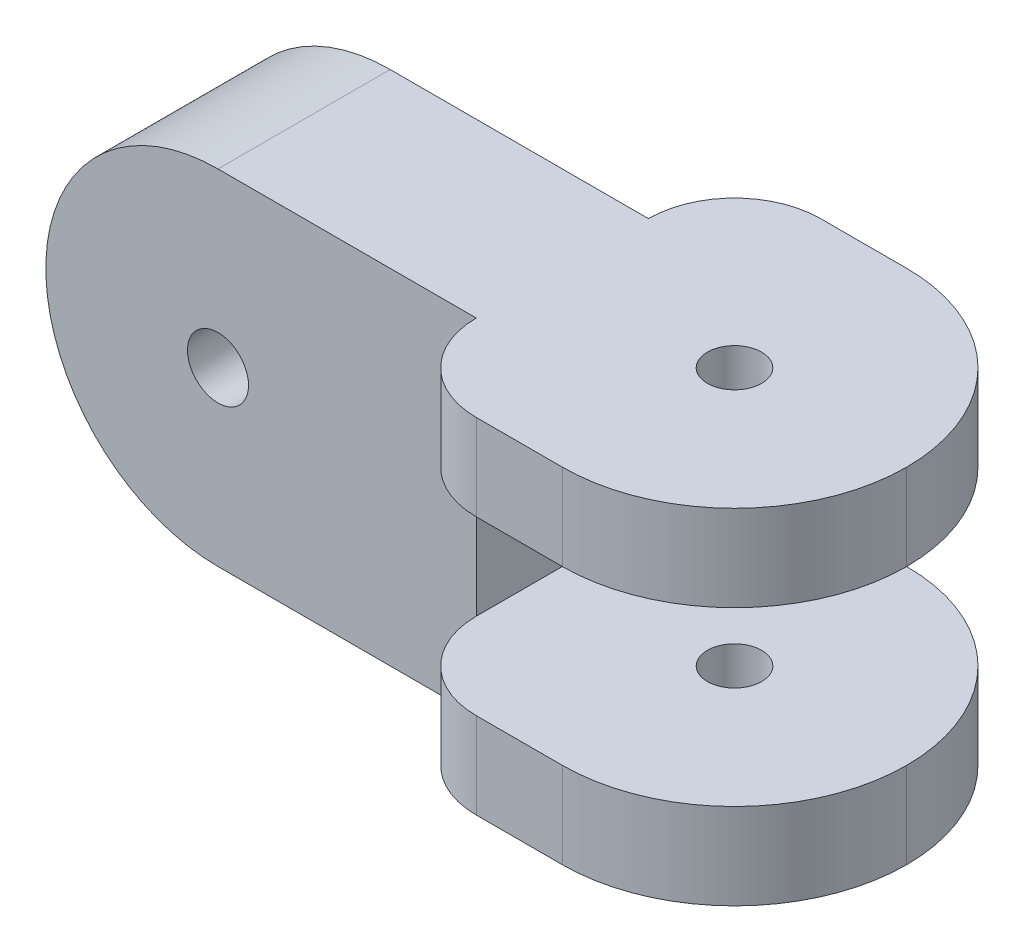
ISO-10303-21;
HEADER;
FILE_DESCRIPTION(('STEP AP214'),'2;1');
FILE_NAME('part.step','',(''),(''),'','','');
FILE_SCHEMA(('AUTOMOTIVE_DESIGN { 1 0 10303 214 1 1 1 1 }'));
ENDSEC;
DATA;
#1=APPLICATION_CONTEXT('core data for automotive mechanical design processes');
#2=APPLICATION_PROTOCOL_DEFINITION('international standard','automotive_design',2000,#1);
#3=PRODUCT_CONTEXT('',#1,'mechanical');
#4=PRODUCT('Part','Part','',(#3));
#5=PRODUCT_RELATED_PRODUCT_CATEGORY('part','',(#4));
#6=PRODUCT_DEFINITION_FORMATION('','',#4);
#7=PRODUCT_DEFINITION_CONTEXT('part definition',#1,'design');
#8=PRODUCT_DEFINITION('design','',#6,#7);
#9=PRODUCT_DEFINITION_SHAPE('','',#8);
#10=(LENGTH_UNIT() NAMED_UNIT(*) SI_UNIT(.MILLI.,.METRE.));
#11=(NAMED_UNIT(*) PLANE_ANGLE_UNIT() SI_UNIT($,.RADIAN.));
#12=(NAMED_UNIT(*) SI_UNIT($,.STERADIAN.) SOLID_ANGLE_UNIT());
#13=UNCERTAINTY_MEASURE_WITH_UNIT(LENGTH_MEASURE(1.E-05),#10,'distance_accuracy_value','');
#14=(GEOMETRIC_REPRESENTATION_CONTEXT(3) GLOBAL_UNCERTAINTY_ASSIGNED_CONTEXT((#13)) GLOBAL_UNIT_ASSIGNED_CONTEXT((#10,
#11,#12)) REPRESENTATION_CONTEXT('',''));
#15=CARTESIAN_POINT('',(0.,0.,0.));
#16=DIRECTION('',(0.,0.,1.));
#17=DIRECTION('',(1.,0.,0.));
#18=AXIS2_PLACEMENT_3D('',#15,#16,#17);
#19=CARTESIAN_POINT('',(44.45,12.7,19.05));
#20=DIRECTION('',(0.,0.,-1.));
#21=DIRECTION('',(-1.,0.,0.));
#22=AXIS2_PLACEMENT_3D('',#19,#20,#21);
#23=PLANE('',#22);
#24=DIRECTION('',(-1.,0.,0.));
#25=VECTOR('',#24,1.);
#26=CARTESIAN_POINT('',(44.45,-12.7,19.05));
#27=LINE('',#26,#25);
#28=CARTESIAN_POINT('',(31.75,-12.7,19.05));
#29=VERTEX_POINT('',#28);
#30=CARTESIAN_POINT('',(25.4,-12.7,19.05));
#31=VERTEX_POINT('',#30);
#32=EDGE_CURVE('E205',#29,#31,#27,.T.);
#33=ORIENTED_EDGE('',*,*,#32,.F.);
#34=DIRECTION('',(0.,-1.,0.));
#35=VECTOR('',#34,1.);
#36=CARTESIAN_POINT('',(31.75,-6.34999999999999,19.05));
#37=LINE('',#36,#35);
#38=CARTESIAN_POINT('',(31.75,-6.34999999999999,19.05));
#39=VERTEX_POINT('',#38);
#40=EDGE_CURVE('E256',#29,#39,#37,.F.);
#41=ORIENTED_EDGE('',*,*,#40,.T.);
#42=DIRECTION('',(1.,0.,0.));
#43=VECTOR('',#42,1.);
#44=CARTESIAN_POINT('',(44.45,-6.34999999999999,19.05));
#45=LINE('',#44,#43);
#46=CARTESIAN_POINT('',(25.4,-6.34999999999999,19.05));
#47=VERTEX_POINT('',#46);
#48=EDGE_CURVE('E282',#47,#39,#45,.T.);
#49=ORIENTED_EDGE('',*,*,#48,.F.);
#50=DIRECTION('',(0.,-1.,0.));
#51=VECTOR('',#50,1.);
#52=CARTESIAN_POINT('',(25.4,12.7,19.05));
#53=LINE('',#52,#51);
#54=EDGE_CURVE('E224',#47,#31,#53,.T.);
#55=ORIENTED_EDGE('',*,*,#54,.T.);
#56=EDGE_LOOP('',(#33,#41,#49,#55));
#57=FACE_BOUND('',#56,.T.);
#58=ADVANCED_FACE('F36',(#57),#23,.F.);
#59=CARTESIAN_POINT('',(44.45,12.7,-6.35));
#60=DIRECTION('',(0.,0.,-1.));
#61=DIRECTION('',(0.,1.,0.));
#62=AXIS2_PLACEMENT_3D('',#59,#60,#61);
#63=PLANE('',#62);
#64=DIRECTION('',(1.,0.,0.));
#65=VECTOR('',#64,1.);
#66=CARTESIAN_POINT('',(44.45,-6.34999999999999,-6.35));
#67=LINE('',#66,#65);
#68=CARTESIAN_POINT('',(25.4,-6.34999999999999,-6.35));
#69=VERTEX_POINT('',#68);
#70=CARTESIAN_POINT('',(31.75,-6.34999999999999,-6.35));
#71=VERTEX_POINT('',#70);
#72=EDGE_CURVE('E174',#69,#71,#67,.T.);
#73=ORIENTED_EDGE('',*,*,#72,.T.);
#74=DIRECTION('',(0.,-1.,0.));
#75=VECTOR('',#74,1.);
#76=CARTESIAN_POINT('',(31.75,12.7,-6.35));
#77=LINE('',#76,#75);
#78=CARTESIAN_POINT('',(31.75,-12.7,-6.35));
#79=VERTEX_POINT('',#78);
#80=EDGE_CURVE('E11',#71,#79,#77,.T.);
#81=ORIENTED_EDGE('',*,*,#80,.T.);
#82=DIRECTION('',(-1.,0.,0.));
#83=VECTOR('',#82,1.);
#84=CARTESIAN_POINT('',(44.45,-12.7,-6.35));
#85=LINE('',#84,#83);
#86=CARTESIAN_POINT('',(25.4,-12.7,-6.35));
#87=VERTEX_POINT('',#86);
#88=EDGE_CURVE('E290',#79,#87,#85,.T.);
#89=ORIENTED_EDGE('',*,*,#88,.T.);
#90=DIRECTION('',(0.,-1.,0.));
#91=VECTOR('',#90,1.);
#92=CARTESIAN_POINT('',(25.4,-6.34999999999999,-6.35));
#93=LINE('',#92,#91);
#94=EDGE_CURVE('E236',#87,#69,#93,.F.);
#95=ORIENTED_EDGE('',*,*,#94,.T.);
#96=EDGE_LOOP('',(#73,#81,#89,#95));
#97=FACE_BOUND('',#96,.T.);
#98=ADVANCED_FACE('F317',(#97),#63,.T.);
#99=CARTESIAN_POINT('',(0.,12.7,12.7));
#100=DIRECTION('',(0.,1.,0.));
#101=DIRECTION('',(0.,0.,1.));
#102=AXIS2_PLACEMENT_3D('',#99,#100,#101);
#103=PLANE('',#102);
#104=CARTESIAN_POINT('',(31.75,12.7,6.35));
#105=DIRECTION('',(0.,1.,0.));
#106=DIRECTION('',(0.,0.,1.));
#107=AXIS2_PLACEMENT_3D('',#104,#105,#106);
#108=CIRCLE('',#107,2.);
#109=CARTESIAN_POINT('',(31.75,12.7,8.35));
#110=VERTEX_POINT('',#109);
#111=EDGE_CURVE('E278',#110,#110,#108,.T.);
#112=ORIENTED_EDGE('',*,*,#111,.F.);
#113=EDGE_LOOP('',(#112));
#114=FACE_BOUND('',#113,.T.);
#115=DIRECTION('',(-1.,0.,0.));
#116=VECTOR('',#115,1.);
#117=CARTESIAN_POINT('',(44.45,12.7,19.05));
#118=LINE('',#117,#116);
#119=CARTESIAN_POINT('',(31.75,12.7,19.05));
#120=VERTEX_POINT('',#119);
#121=CARTESIAN_POINT('',(25.4,12.7,19.05));
#122=VERTEX_POINT('',#121);
#123=EDGE_CURVE('E187',#120,#122,#118,.T.);
#124=ORIENTED_EDGE('',*,*,#123,.F.);
#125=CARTESIAN_POINT('',(31.75,12.7,6.35));
#126=DIRECTION('',(0.,1.,0.));
#127=DIRECTION('',(0.,0.,1.));
#128=AXIS2_PLACEMENT_3D('',#125,#126,#127);
#129=CIRCLE('',#128,12.7);
#130=CARTESIAN_POINT('',(44.45,12.7,6.35));
#131=VERTEX_POINT('',#130);
#132=EDGE_CURVE('E250',#120,#131,#129,.T.);
#133=ORIENTED_EDGE('',*,*,#132,.T.);
#134=CARTESIAN_POINT('',(31.75,12.7,6.35));
#135=DIRECTION('',(0.,1.,0.));
#136=DIRECTION('',(0.,0.,1.));
#137=AXIS2_PLACEMENT_3D('',#134,#135,#136);
#138=CIRCLE('',#137,12.7);
#139=CARTESIAN_POINT('',(31.75,12.7,-6.35));
#140=VERTEX_POINT('',#139);
#141=EDGE_CURVE('E248',#131,#140,#138,.T.);
#142=ORIENTED_EDGE('',*,*,#141,.T.);
#143=DIRECTION('',(-1.,0.,0.));
#144=VECTOR('',#143,1.);
#145=CARTESIAN_POINT('',(44.45,12.7,-6.35));
#146=LINE('',#145,#144);
#147=CARTESIAN_POINT('',(25.4,12.7,-6.35));
#148=VERTEX_POINT('',#147);
#149=EDGE_CURVE('E288',#140,#148,#146,.T.);
#150=ORIENTED_EDGE('',*,*,#149,.T.);
#151=CARTESIAN_POINT('',(25.4,12.7,0.));
#152=DIRECTION('',(0.,1.,0.));
#153=DIRECTION('',(0.,0.,1.));
#154=AXIS2_PLACEMENT_3D('',#151,#152,#153);
#155=CIRCLE('',#154,6.35);
#156=CARTESIAN_POINT('',(19.05,12.7,0.));
#157=VERTEX_POINT('',#156);
#158=EDGE_CURVE('E161',#148,#157,#155,.T.);
#159=ORIENTED_EDGE('',*,*,#158,.T.);
#160=DIRECTION('',(1.,0.,0.));
#161=VECTOR('',#160,1.);
#162=CARTESIAN_POINT('',(0.,12.7,0.));
#163=LINE('',#162,#161);
#164=CARTESIAN_POINT('',(0.,12.7,0.));
#165=VERTEX_POINT('',#164);
#166=EDGE_CURVE('E204',#165,#157,#163,.T.);
#167=ORIENTED_EDGE('',*,*,#166,.F.);
#168=DIRECTION('',(0.,0.,-1.));
#169=VECTOR('',#168,1.);
#170=CARTESIAN_POINT('',(0.,12.7,12.7));
#171=LINE('',#170,#169);
#172=CARTESIAN_POINT('',(0.,12.7,12.7));
#173=VERTEX_POINT('',#172);
#174=EDGE_CURVE('E195',#173,#165,#171,.T.);
#175=ORIENTED_EDGE('',*,*,#174,.F.);
#176=DIRECTION('',(1.,0.,0.));
#177=VECTOR('',#176,1.);
#178=CARTESIAN_POINT('',(0.,12.7,12.7));
#179=LINE('',#178,#177);
#180=CARTESIAN_POINT('',(19.05,12.7,12.7));
#181=VERTEX_POINT('',#180);
#182=EDGE_CURVE('E295',#173,#181,#179,.T.);
#183=ORIENTED_EDGE('',*,*,#182,.T.);
#184=CARTESIAN_POINT('',(25.4,12.7,12.7));
#185=DIRECTION('',(0.,1.,0.));
#186=DIRECTION('',(0.,0.,1.));
#187=AXIS2_PLACEMENT_3D('',#184,#185,#186);
#188=CIRCLE('',#187,6.35);
#189=EDGE_CURVE('E191',#181,#122,#188,.T.);
#190=ORIENTED_EDGE('',*,*,#189,.T.);
#191=EDGE_LOOP('',(#124,#133,#142,#150,#159,#167,#175,#183,#190));
#192=FACE_BOUND('',#191,.T.);
#193=ADVANCED_FACE('F349',(#114,#192),#103,.T.);
#194=CARTESIAN_POINT('',(0.,0.,12.7));
#195=DIRECTION('',(0.,0.,-1.));
#196=DIRECTION('',(-1.,0.,0.));
#197=AXIS2_PLACEMENT_3D('',#194,#195,#196);
#198=CYLINDRICAL_SURFACE('',#197,12.7);
#199=CARTESIAN_POINT('',(0.,0.,0.));
#200=DIRECTION('',(0.,0.,1.));
#201=DIRECTION('',(1.,0.,0.));
#202=AXIS2_PLACEMENT_3D('',#199,#200,#201);
#203=CIRCLE('',#202,12.7);
#204=CARTESIAN_POINT('',(0.,-12.7,0.));
#205=VERTEX_POINT('',#204);
#206=EDGE_CURVE('E208',#165,#205,#203,.T.);
#207=ORIENTED_EDGE('',*,*,#206,.T.);
#208=DIRECTION('',(0.,0.,-1.));
#209=VECTOR('',#208,1.);
#210=CARTESIAN_POINT('',(0.,-12.7,12.7));
#211=LINE('',#210,#209);
#212=CARTESIAN_POINT('',(0.,-12.7,12.7));
#213=VERTEX_POINT('',#212);
#214=EDGE_CURVE('E192',#213,#205,#211,.T.);
#215=ORIENTED_EDGE('',*,*,#214,.F.);
#216=CARTESIAN_POINT('',(0.,0.,12.7));
#217=DIRECTION('',(0.,0.,1.));
#218=DIRECTION('',(1.,0.,0.));
#219=AXIS2_PLACEMENT_3D('',#216,#217,#218);
#220=CIRCLE('',#219,12.7);
#221=EDGE_CURVE('E296',#173,#213,#220,.T.);
#222=ORIENTED_EDGE('',*,*,#221,.F.);
#223=ORIENTED_EDGE('',*,*,#174,.T.);
#224=EDGE_LOOP('',(#207,#215,#222,#223));
#225=FACE_BOUND('',#224,.T.);
#226=ADVANCED_FACE('F351',(#225),#198,.T.);
#227=CARTESIAN_POINT('',(0.,-12.7,12.7));
#228=DIRECTION('',(0.,1.,0.));
#229=DIRECTION('',(0.,0.,1.));
#230=AXIS2_PLACEMENT_3D('',#227,#228,#229);
#231=PLANE('',#230);
#232=CARTESIAN_POINT('',(31.75,-12.7,6.35));
#233=DIRECTION('',(0.,1.,0.));
#234=DIRECTION('',(0.,0.,1.));
#235=AXIS2_PLACEMENT_3D('',#232,#233,#234);
#236=CIRCLE('',#235,2.);
#237=CARTESIAN_POINT('',(31.75,-12.7,8.35));
#238=VERTEX_POINT('',#237);
#239=EDGE_CURVE('E275',#238,#238,#236,.T.);
#240=ORIENTED_EDGE('',*,*,#239,.T.);
#241=EDGE_LOOP('',(#240));
#242=FACE_BOUND('',#241,.T.);
#243=CARTESIAN_POINT('',(31.75,-12.7,6.34999999999999));
#244=DIRECTION('',(0.,1.,0.));
#245=DIRECTION('',(0.,0.,1.));
#246=AXIS2_PLACEMENT_3D('',#243,#244,#245);
#247=CIRCLE('',#246,12.7);
#248=CARTESIAN_POINT('',(44.45,-12.7,6.35));
#249=VERTEX_POINT('',#248);
#250=EDGE_CURVE('E252',#79,#249,#247,.F.);
#251=ORIENTED_EDGE('',*,*,#250,.T.);
#252=CARTESIAN_POINT('',(31.75,-12.7,6.35));
#253=DIRECTION('',(0.,1.,0.));
#254=DIRECTION('',(0.,0.,1.));
#255=AXIS2_PLACEMENT_3D('',#252,#253,#254);
#256=CIRCLE('',#255,12.7);
#257=EDGE_CURVE('E254',#249,#29,#256,.F.);
#258=ORIENTED_EDGE('',*,*,#257,.T.);
#259=ORIENTED_EDGE('',*,*,#32,.T.);
#260=CARTESIAN_POINT('',(25.4,-12.7,12.7));
#261=DIRECTION('',(0.,1.,0.));
#262=DIRECTION('',(0.,0.,1.));
#263=AXIS2_PLACEMENT_3D('',#260,#261,#262);
#264=CIRCLE('',#263,6.35);
#265=CARTESIAN_POINT('',(19.05,-12.7,12.7));
#266=VERTEX_POINT('',#265);
#267=EDGE_CURVE('E230',#31,#266,#264,.F.);
#268=ORIENTED_EDGE('',*,*,#267,.T.);
#269=DIRECTION('',(1.,0.,0.));
#270=VECTOR('',#269,1.);
#271=CARTESIAN_POINT('',(0.,-12.7,12.7));
#272=LINE('',#271,#270);
#273=EDGE_CURVE('E197',#213,#266,#272,.T.);
#274=ORIENTED_EDGE('',*,*,#273,.F.);
#275=ORIENTED_EDGE('',*,*,#214,.T.);
#276=DIRECTION('',(1.,0.,0.));
#277=VECTOR('',#276,1.);
#278=CARTESIAN_POINT('',(0.,-12.7,0.));
#279=LINE('',#278,#277);
#280=CARTESIAN_POINT('',(19.05,-12.7,0.));
#281=VERTEX_POINT('',#280);
#282=EDGE_CURVE('E211',#205,#281,#279,.T.);
#283=ORIENTED_EDGE('',*,*,#282,.T.);
#284=CARTESIAN_POINT('',(25.4,-12.7,0.));
#285=DIRECTION('',(0.,1.,0.));
#286=DIRECTION('',(0.,0.,1.));
#287=AXIS2_PLACEMENT_3D('',#284,#285,#286);
#288=CIRCLE('',#287,6.35);
#289=EDGE_CURVE('E227',#281,#87,#288,.F.);
#290=ORIENTED_EDGE('',*,*,#289,.T.);
#291=ORIENTED_EDGE('',*,*,#88,.F.);
#292=EDGE_LOOP('',(#251,#258,#259,#268,#274,#275,#283,#290,#291));
#293=FACE_BOUND('',#292,.T.);
#294=ADVANCED_FACE('F311',(#242,#293),#231,.F.);
#295=CARTESIAN_POINT('',(0.,0.,12.7));
#296=DIRECTION('',(0.,0.,-1.));
#297=DIRECTION('',(-1.,0.,0.));
#298=AXIS2_PLACEMENT_3D('',#295,#296,#297);
#299=CYLINDRICAL_SURFACE('',#298,2.25);
#300=CARTESIAN_POINT('',(0.,0.,12.7));
#301=DIRECTION('',(0.,0.,1.));
#302=DIRECTION('',(1.,0.,0.));
#303=AXIS2_PLACEMENT_3D('',#300,#301,#302);
#304=CIRCLE('',#303,2.25);
#305=CARTESIAN_POINT('',(2.25,0.,12.7));
#306=VERTEX_POINT('',#305);
#307=EDGE_CURVE('E216',#306,#306,#304,.T.);
#308=ORIENTED_EDGE('',*,*,#307,.T.);
#309=EDGE_LOOP('',(#308));
#310=FACE_BOUND('',#309,.T.);
#311=CARTESIAN_POINT('',(0.,0.,0.));
#312=DIRECTION('',(0.,0.,1.));
#313=DIRECTION('',(1.,0.,0.));
#314=AXIS2_PLACEMENT_3D('',#311,#312,#313);
#315=CIRCLE('',#314,2.25);
#316=CARTESIAN_POINT('',(2.25,0.,0.));
#317=VERTEX_POINT('',#316);
#318=EDGE_CURVE('E201',#317,#317,#315,.T.);
#319=ORIENTED_EDGE('',*,*,#318,.F.);
#320=EDGE_LOOP('',(#319));
#321=FACE_BOUND('',#320,.T.);
#322=ADVANCED_FACE('F358',(#310,#321),#299,.F.);
#323=CARTESIAN_POINT('',(0.,0.,12.7));
#324=DIRECTION('',(0.,0.,1.));
#325=DIRECTION('',(1.,0.,0.));
#326=AXIS2_PLACEMENT_3D('',#323,#324,#325);
#327=PLANE('',#326);
#328=ORIENTED_EDGE('',*,*,#307,.F.);
#329=EDGE_LOOP('',(#328));
#330=FACE_BOUND('',#329,.T.);
#331=ORIENTED_EDGE('',*,*,#182,.F.);
#332=ORIENTED_EDGE('',*,*,#221,.T.);
#333=ORIENTED_EDGE('',*,*,#273,.T.);
#334=DIRECTION('',(0.,-1.,0.));
#335=VECTOR('',#334,1.);
#336=CARTESIAN_POINT('',(19.05,0.,12.7));
#337=LINE('',#336,#335);
#338=CARTESIAN_POINT('',(19.05,-6.34999999999999,12.7));
#339=VERTEX_POINT('',#338);
#340=EDGE_CURVE('E185',#339,#266,#337,.T.);
#341=ORIENTED_EDGE('',*,*,#340,.F.);
#342=DIRECTION('',(0.,-1.,0.));
#343=VECTOR('',#342,1.);
#344=CARTESIAN_POINT('',(19.05,0.,12.7));
#345=LINE('',#344,#343);
#346=CARTESIAN_POINT('',(19.05,6.35000000000001,12.7));
#347=VERTEX_POINT('',#346);
#348=EDGE_CURVE('E168',#347,#339,#345,.T.);
#349=ORIENTED_EDGE('',*,*,#348,.F.);
#350=EDGE_CURVE('E181',#181,#347,#337,.T.);
#351=ORIENTED_EDGE('',*,*,#350,.F.);
#352=EDGE_LOOP('',(#331,#332,#333,#341,#349,#351));
#353=FACE_BOUND('',#352,.T.);
#354=ADVANCED_FACE('F180',(#330,#353),#327,.T.);
#355=CARTESIAN_POINT('',(0.,0.,0.));
#356=DIRECTION('',(0.,0.,1.));
#357=DIRECTION('',(1.,0.,0.));
#358=AXIS2_PLACEMENT_3D('',#355,#356,#357);
#359=PLANE('',#358);
#360=ORIENTED_EDGE('',*,*,#318,.T.);
#361=EDGE_LOOP('',(#360));
#362=FACE_BOUND('',#361,.T.);
#363=ORIENTED_EDGE('',*,*,#166,.T.);
#364=DIRECTION('',(0.,-1.,0.));
#365=VECTOR('',#364,1.);
#366=CARTESIAN_POINT('',(19.05,0.,0.));
#367=LINE('',#366,#365);
#368=CARTESIAN_POINT('',(19.05,6.35000000000001,0.));
#369=VERTEX_POINT('',#368);
#370=EDGE_CURVE('E215',#157,#369,#367,.T.);
#371=ORIENTED_EDGE('',*,*,#370,.T.);
#372=CARTESIAN_POINT('',(19.05,-6.34999999999999,0.));
#373=VERTEX_POINT('',#372);
#374=EDGE_CURVE('E171',#369,#373,#367,.T.);
#375=ORIENTED_EDGE('',*,*,#374,.T.);
#376=EDGE_CURVE('E214',#373,#281,#367,.T.);
#377=ORIENTED_EDGE('',*,*,#376,.T.);
#378=ORIENTED_EDGE('',*,*,#282,.F.);
#379=ORIENTED_EDGE('',*,*,#206,.F.);
#380=EDGE_LOOP('',(#363,#371,#375,#377,#378,#379));
#381=FACE_BOUND('',#380,.T.);
#382=ADVANCED_FACE('F325',(#362,#381),#359,.F.);
#383=DIRECTION('',(-1.,0.,0.));
#384=VECTOR('',#383,1.);
#385=CARTESIAN_POINT('',(44.45,6.35000000000001,19.05));
#386=LINE('',#385,#384);
#387=CARTESIAN_POINT('',(31.75,6.35000000000001,19.05));
#388=VERTEX_POINT('',#387);
#389=CARTESIAN_POINT('',(25.4,6.35000000000001,19.05));
#390=VERTEX_POINT('',#389);
#391=EDGE_CURVE('E156',#388,#390,#386,.T.);
#392=ORIENTED_EDGE('',*,*,#391,.F.);
#393=DIRECTION('',(0.,-1.,0.));
#394=VECTOR('',#393,1.);
#395=CARTESIAN_POINT('',(31.75,12.7,19.05));
#396=LINE('',#395,#394);
#397=EDGE_CURVE('E245',#388,#120,#396,.F.);
#398=ORIENTED_EDGE('',*,*,#397,.T.);
#399=ORIENTED_EDGE('',*,*,#123,.T.);
#400=DIRECTION('',(0.,-1.,0.));
#401=VECTOR('',#400,1.);
#402=CARTESIAN_POINT('',(25.4,12.7,19.05));
#403=LINE('',#402,#401);
#404=EDGE_CURVE('E219',#122,#390,#403,.T.);
#405=ORIENTED_EDGE('',*,*,#404,.T.);
#406=EDGE_LOOP('',(#392,#398,#399,#405));
#407=FACE_BOUND('',#406,.T.);
#408=ADVANCED_FACE('F346',(#407),#23,.F.);
#409=ORIENTED_EDGE('',*,*,#149,.F.);
#410=DIRECTION('',(0.,-1.,0.));
#411=VECTOR('',#410,1.);
#412=CARTESIAN_POINT('',(31.75,12.7,-6.35));
#413=LINE('',#412,#411);
#414=CARTESIAN_POINT('',(31.75,6.35000000000001,-6.35));
#415=VERTEX_POINT('',#414);
#416=EDGE_CURVE('E45',#140,#415,#413,.T.);
#417=ORIENTED_EDGE('',*,*,#416,.T.);
#418=DIRECTION('',(-1.,0.,0.));
#419=VECTOR('',#418,1.);
#420=CARTESIAN_POINT('',(44.45,6.35000000000001,-6.35));
#421=LINE('',#420,#419);
#422=CARTESIAN_POINT('',(25.4,6.35000000000001,-6.35));
#423=VERTEX_POINT('',#422);
#424=EDGE_CURVE('E280',#415,#423,#421,.T.);
#425=ORIENTED_EDGE('',*,*,#424,.T.);
#426=DIRECTION('',(0.,-1.,0.));
#427=VECTOR('',#426,1.);
#428=CARTESIAN_POINT('',(25.4,12.7,-6.35));
#429=LINE('',#428,#427);
#430=EDGE_CURVE('E238',#423,#148,#429,.F.);
#431=ORIENTED_EDGE('',*,*,#430,.T.);
#432=EDGE_LOOP('',(#409,#417,#425,#431));
#433=FACE_BOUND('',#432,.T.);
#434=ADVANCED_FACE('F369',(#433),#63,.T.);
#435=CARTESIAN_POINT('',(19.05,6.35000000000001,-6.35));
#436=DIRECTION('',(-1.,0.,0.));
#437=DIRECTION('',(0.,0.,1.));
#438=AXIS2_PLACEMENT_3D('',#435,#436,#437);
#439=PLANE('',#438);
#440=ORIENTED_EDGE('',*,*,#348,.T.);
#441=DIRECTION('',(0.,0.,1.));
#442=VECTOR('',#441,1.);
#443=CARTESIAN_POINT('',(19.05,-6.34999999999999,-6.35));
#444=LINE('',#443,#442);
#445=EDGE_CURVE('E173',#373,#339,#444,.T.);
#446=ORIENTED_EDGE('',*,*,#445,.F.);
#447=ORIENTED_EDGE('',*,*,#374,.F.);
#448=DIRECTION('',(0.,0.,1.));
#449=VECTOR('',#448,1.);
#450=CARTESIAN_POINT('',(19.05,6.35000000000001,-6.35));
#451=LINE('',#450,#449);
#452=EDGE_CURVE('E153',#369,#347,#451,.T.);
#453=ORIENTED_EDGE('',*,*,#452,.T.);
#454=EDGE_LOOP('',(#440,#446,#447,#453));
#455=FACE_BOUND('',#454,.T.);
#456=ADVANCED_FACE('F166',(#455),#439,.F.);
#457=CARTESIAN_POINT('',(44.45,-6.34999999999999,-6.35));
#458=DIRECTION('',(0.,-1.,0.));
#459=DIRECTION('',(1.,0.,0.));
#460=AXIS2_PLACEMENT_3D('',#457,#458,#459);
#461=PLANE('',#460);
#462=CARTESIAN_POINT('',(31.75,-6.34999999999999,6.35));
#463=DIRECTION('',(0.,-1.,0.));
#464=DIRECTION('',(1.,0.,0.));
#465=AXIS2_PLACEMENT_3D('',#462,#463,#464);
#466=CIRCLE('',#465,2.);
#467=CARTESIAN_POINT('',(33.75,-6.34999999999999,6.35));
#468=VERTEX_POINT('',#467);
#469=EDGE_CURVE('E266',#468,#468,#466,.T.);
#470=ORIENTED_EDGE('',*,*,#469,.T.);
#471=EDGE_LOOP('',(#470));
#472=FACE_BOUND('',#471,.T.);
#473=ORIENTED_EDGE('',*,*,#48,.T.);
#474=CARTESIAN_POINT('',(31.75,-6.34999999999999,6.35));
#475=DIRECTION('',(0.,-1.,0.));
#476=DIRECTION('',(1.,0.,0.));
#477=AXIS2_PLACEMENT_3D('',#474,#475,#476);
#478=CIRCLE('',#477,12.7);
#479=CARTESIAN_POINT('',(44.45,-6.34999999999999,6.34999999999999));
#480=VERTEX_POINT('',#479);
#481=EDGE_CURVE('E58',#39,#480,#478,.F.);
#482=ORIENTED_EDGE('',*,*,#481,.T.);
#483=CARTESIAN_POINT('',(31.75,-6.34999999999999,6.35));
#484=DIRECTION('',(0.,-1.,0.));
#485=DIRECTION('',(1.,0.,0.));
#486=AXIS2_PLACEMENT_3D('',#483,#484,#485);
#487=CIRCLE('',#486,12.7);
#488=EDGE_CURVE('E53',#480,#71,#487,.F.);
#489=ORIENTED_EDGE('',*,*,#488,.T.);
#490=ORIENTED_EDGE('',*,*,#72,.F.);
#491=CARTESIAN_POINT('',(25.4,-6.34999999999999,0.));
#492=DIRECTION('',(0.,-1.,0.));
#493=DIRECTION('',(1.,0.,0.));
#494=AXIS2_PLACEMENT_3D('',#491,#492,#493);
#495=CIRCLE('',#494,6.35);
#496=EDGE_CURVE('E232',#69,#373,#495,.F.);
#497=ORIENTED_EDGE('',*,*,#496,.T.);
#498=ORIENTED_EDGE('',*,*,#445,.T.);
#499=CARTESIAN_POINT('',(25.4,-6.34999999999999,12.7));
#500=DIRECTION('',(0.,-1.,0.));
#501=DIRECTION('',(1.,0.,0.));
#502=AXIS2_PLACEMENT_3D('',#499,#500,#501);
#503=CIRCLE('',#502,6.35);
#504=EDGE_CURVE('E234',#339,#47,#503,.F.);
#505=ORIENTED_EDGE('',*,*,#504,.T.);
#506=EDGE_LOOP('',(#473,#482,#489,#490,#497,#498,#505));
#507=FACE_BOUND('',#506,.T.);
#508=ADVANCED_FACE('F306',(#472,#507),#461,.F.);
#509=CARTESIAN_POINT('',(44.45,6.35000000000001,-6.35));
#510=DIRECTION('',(0.,1.,0.));
#511=DIRECTION('',(-1.,0.,0.));
#512=AXIS2_PLACEMENT_3D('',#509,#510,#511);
#513=PLANE('',#512);
#514=CARTESIAN_POINT('',(31.75,6.35000000000001,6.35));
#515=DIRECTION('',(0.,1.,0.));
#516=DIRECTION('',(-1.,0.,0.));
#517=AXIS2_PLACEMENT_3D('',#514,#515,#516);
#518=CIRCLE('',#517,2.);
#519=CARTESIAN_POINT('',(29.75,6.35000000000001,6.35));
#520=VERTEX_POINT('',#519);
#521=EDGE_CURVE('E40',#520,#520,#518,.T.);
#522=ORIENTED_EDGE('',*,*,#521,.T.);
#523=EDGE_LOOP('',(#522));
#524=FACE_BOUND('',#523,.T.);
#525=CARTESIAN_POINT('',(31.75,6.35000000000001,6.35));
#526=DIRECTION('',(0.,1.,0.));
#527=DIRECTION('',(-1.,0.,0.));
#528=AXIS2_PLACEMENT_3D('',#525,#526,#527);
#529=CIRCLE('',#528,12.7);
#530=CARTESIAN_POINT('',(44.45,6.35000000000001,6.35));
#531=VERTEX_POINT('',#530);
#532=EDGE_CURVE('E241',#415,#531,#529,.F.);
#533=ORIENTED_EDGE('',*,*,#532,.T.);
#534=CARTESIAN_POINT('',(31.75,6.35000000000001,6.35));
#535=DIRECTION('',(0.,1.,0.));
#536=DIRECTION('',(-1.,0.,0.));
#537=AXIS2_PLACEMENT_3D('',#534,#535,#536);
#538=CIRCLE('',#537,12.7);
#539=EDGE_CURVE('E243',#531,#388,#538,.F.);
#540=ORIENTED_EDGE('',*,*,#539,.T.);
#541=ORIENTED_EDGE('',*,*,#391,.T.);
#542=CARTESIAN_POINT('',(25.4,6.35000000000001,12.7));
#543=DIRECTION('',(0.,1.,0.));
#544=DIRECTION('',(-1.,0.,0.));
#545=AXIS2_PLACEMENT_3D('',#542,#543,#544);
#546=CIRCLE('',#545,6.35);
#547=EDGE_CURVE('E149',#390,#347,#546,.F.);
#548=ORIENTED_EDGE('',*,*,#547,.T.);
#549=ORIENTED_EDGE('',*,*,#452,.F.);
#550=CARTESIAN_POINT('',(25.4,6.35000000000001,0.));
#551=DIRECTION('',(0.,1.,0.));
#552=DIRECTION('',(-1.,0.,0.));
#553=AXIS2_PLACEMENT_3D('',#550,#551,#552);
#554=CIRCLE('',#553,6.35);
#555=EDGE_CURVE('E162',#369,#423,#554,.F.);
#556=ORIENTED_EDGE('',*,*,#555,.T.);
#557=ORIENTED_EDGE('',*,*,#424,.F.);
#558=EDGE_LOOP('',(#533,#540,#541,#548,#549,#556,#557));
#559=FACE_BOUND('',#558,.T.);
#560=ADVANCED_FACE('F151',(#524,#559),#513,.F.);
#561=CARTESIAN_POINT('',(25.4,12.7,12.7));
#562=DIRECTION('',(0.,-1.,0.));
#563=DIRECTION('',(1.,0.,0.));
#564=AXIS2_PLACEMENT_3D('',#561,#562,#563);
#565=CYLINDRICAL_SURFACE('',#564,6.35);
#566=ORIENTED_EDGE('',*,*,#189,.F.);
#567=ORIENTED_EDGE('',*,*,#350,.T.);
#568=ORIENTED_EDGE('',*,*,#547,.F.);
#569=ORIENTED_EDGE('',*,*,#404,.F.);
#570=EDGE_LOOP('',(#566,#567,#568,#569));
#571=FACE_BOUND('',#570,.T.);
#572=ADVANCED_FACE('F189',(#571),#565,.T.);
#573=CARTESIAN_POINT('',(25.4,12.7,12.7));
#574=DIRECTION('',(0.,-1.,0.));
#575=DIRECTION('',(1.,0.,0.));
#576=AXIS2_PLACEMENT_3D('',#573,#574,#575);
#577=CYLINDRICAL_SURFACE('',#576,6.35);
#578=ORIENTED_EDGE('',*,*,#504,.F.);
#579=ORIENTED_EDGE('',*,*,#340,.T.);
#580=ORIENTED_EDGE('',*,*,#267,.F.);
#581=ORIENTED_EDGE('',*,*,#54,.F.);
#582=EDGE_LOOP('',(#578,#579,#580,#581));
#583=FACE_BOUND('',#582,.T.);
#584=ADVANCED_FACE('F303',(#583),#577,.T.);
#585=CARTESIAN_POINT('',(25.4,0.,0.));
#586=DIRECTION('',(0.,1.,0.));
#587=DIRECTION('',(-1.,0.,0.));
#588=AXIS2_PLACEMENT_3D('',#585,#586,#587);
#589=CYLINDRICAL_SURFACE('',#588,6.35);
#590=ORIENTED_EDGE('',*,*,#496,.F.);
#591=ORIENTED_EDGE('',*,*,#94,.F.);
#592=ORIENTED_EDGE('',*,*,#289,.F.);
#593=ORIENTED_EDGE('',*,*,#376,.F.);
#594=EDGE_LOOP('',(#590,#591,#592,#593));
#595=FACE_BOUND('',#594,.T.);
#596=ADVANCED_FACE('F322',(#595),#589,.T.);
#597=CARTESIAN_POINT('',(25.4,0.,0.));
#598=DIRECTION('',(0.,1.,0.));
#599=DIRECTION('',(-1.,0.,0.));
#600=AXIS2_PLACEMENT_3D('',#597,#598,#599);
#601=CYLINDRICAL_SURFACE('',#600,6.35);
#602=ORIENTED_EDGE('',*,*,#158,.F.);
#603=ORIENTED_EDGE('',*,*,#430,.F.);
#604=ORIENTED_EDGE('',*,*,#555,.F.);
#605=ORIENTED_EDGE('',*,*,#370,.F.);
#606=EDGE_LOOP('',(#602,#603,#604,#605));
#607=FACE_BOUND('',#606,.T.);
#608=ADVANCED_FACE('F331',(#607),#601,.T.);
#609=CARTESIAN_POINT('',(31.75,12.7,6.35));
#610=DIRECTION('',(0.,-1.,0.));
#611=DIRECTION('',(1.,0.,0.));
#612=AXIS2_PLACEMENT_3D('',#609,#610,#611);
#613=CYLINDRICAL_SURFACE('',#612,12.7);
#614=ORIENTED_EDGE('',*,*,#416,.F.);
#615=ORIENTED_EDGE('',*,*,#141,.F.);
#616=DIRECTION('',(0.,-1.,0.));
#617=VECTOR('',#616,1.);
#618=CARTESIAN_POINT('',(44.45,0.,6.35));
#619=LINE('',#618,#617);
#620=EDGE_CURVE('E262',#531,#131,#619,.F.);
#621=ORIENTED_EDGE('',*,*,#620,.F.);
#622=ORIENTED_EDGE('',*,*,#532,.F.);
#623=EDGE_LOOP('',(#614,#615,#621,#622));
#624=FACE_BOUND('',#623,.T.);
#625=ADVANCED_FACE('F339',(#624),#613,.T.);
#626=CARTESIAN_POINT('',(31.75,0.,6.35));
#627=DIRECTION('',(0.,1.,0.));
#628=DIRECTION('',(-1.,0.,0.));
#629=AXIS2_PLACEMENT_3D('',#626,#627,#628);
#630=CYLINDRICAL_SURFACE('',#629,12.7);
#631=ORIENTED_EDGE('',*,*,#132,.F.);
#632=ORIENTED_EDGE('',*,*,#397,.F.);
#633=ORIENTED_EDGE('',*,*,#539,.F.);
#634=ORIENTED_EDGE('',*,*,#620,.T.);
#635=EDGE_LOOP('',(#631,#632,#633,#634));
#636=FACE_BOUND('',#635,.T.);
#637=ADVANCED_FACE('F344',(#636),#630,.T.);
#638=CARTESIAN_POINT('',(31.75,12.7,6.35));
#639=DIRECTION('',(0.,-1.,0.));
#640=DIRECTION('',(1.,0.,0.));
#641=AXIS2_PLACEMENT_3D('',#638,#639,#640);
#642=CYLINDRICAL_SURFACE('',#641,12.7);
#643=ORIENTED_EDGE('',*,*,#80,.F.);
#644=ORIENTED_EDGE('',*,*,#488,.F.);
#645=DIRECTION('',(0.,-1.,0.));
#646=VECTOR('',#645,1.);
#647=CARTESIAN_POINT('',(44.45,0.,6.35));
#648=LINE('',#647,#646);
#649=EDGE_CURVE('E264',#249,#480,#648,.F.);
#650=ORIENTED_EDGE('',*,*,#649,.F.);
#651=ORIENTED_EDGE('',*,*,#250,.F.);
#652=EDGE_LOOP('',(#643,#644,#650,#651));
#653=FACE_BOUND('',#652,.T.);
#654=ADVANCED_FACE('F38',(#653),#642,.T.);
#655=CARTESIAN_POINT('',(31.75,0.,6.35));
#656=DIRECTION('',(0.,1.,0.));
#657=DIRECTION('',(-1.,0.,0.));
#658=AXIS2_PLACEMENT_3D('',#655,#656,#657);
#659=CYLINDRICAL_SURFACE('',#658,12.7);
#660=ORIENTED_EDGE('',*,*,#481,.F.);
#661=ORIENTED_EDGE('',*,*,#40,.F.);
#662=ORIENTED_EDGE('',*,*,#257,.F.);
#663=ORIENTED_EDGE('',*,*,#649,.T.);
#664=EDGE_LOOP('',(#660,#661,#662,#663));
#665=FACE_BOUND('',#664,.T.);
#666=ADVANCED_FACE('F310',(#665),#659,.T.);
#667=CARTESIAN_POINT('',(31.75,-12.7,6.35));
#668=DIRECTION('',(0.,1.,0.));
#669=DIRECTION('',(0.,0.,1.));
#670=AXIS2_PLACEMENT_3D('',#667,#668,#669);
#671=CYLINDRICAL_SURFACE('',#670,2.);
#672=ORIENTED_EDGE('',*,*,#111,.T.);
#673=EDGE_LOOP('',(#672));
#674=FACE_BOUND('',#673,.T.);
#675=ORIENTED_EDGE('',*,*,#521,.F.);
#676=EDGE_LOOP('',(#675));
#677=FACE_BOUND('',#676,.T.);
#678=ADVANCED_FACE('F402',(#674,#677),#671,.F.);
#679=ORIENTED_EDGE('',*,*,#239,.F.);
#680=EDGE_LOOP('',(#679));
#681=FACE_BOUND('',#680,.T.);
#682=ORIENTED_EDGE('',*,*,#469,.F.);
#683=EDGE_LOOP('',(#682));
#684=FACE_BOUND('',#683,.T.);
#685=ADVANCED_FACE('F407',(#681,#684),#671,.F.);
#686=CLOSED_SHELL('',(#58,#98,#193,#226,#294,#322,#354,#382,#408,#434,#456,#508,#560,#572,#584,
#596,#608,#625,#637,#654,#666,#678,#685));
#687=MANIFOLD_SOLID_BREP('B2',#686);
#688=ADVANCED_BREP_SHAPE_REPRESENTATION('',(#18,#687),#14);
#689=SHAPE_DEFINITION_REPRESENTATION(#9,#688);
ENDSEC;
END-ISO-10303-21;
